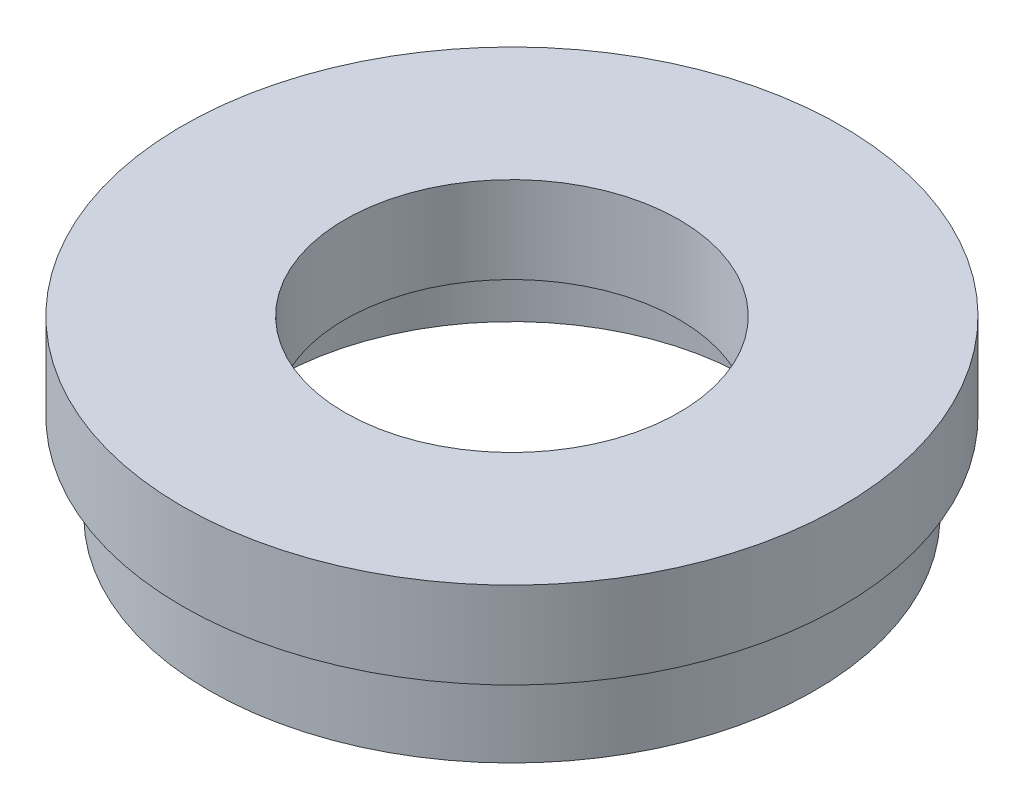
ISO-10303-21;
HEADER;
FILE_DESCRIPTION(('STEP AP214'),'2;1');
FILE_NAME('part.step','',(''),(''),'','','');
FILE_SCHEMA(('AUTOMOTIVE_DESIGN { 1 0 10303 214 1 1 1 1 }'));
ENDSEC;
DATA;
#1=APPLICATION_CONTEXT('core data for automotive mechanical design processes');
#2=APPLICATION_PROTOCOL_DEFINITION('international standard','automotive_design',2000,#1);
#3=PRODUCT_CONTEXT('',#1,'mechanical');
#4=PRODUCT('Part','Part','',(#3));
#5=PRODUCT_RELATED_PRODUCT_CATEGORY('part','',(#4));
#6=PRODUCT_DEFINITION_FORMATION('','',#4);
#7=PRODUCT_DEFINITION_CONTEXT('part definition',#1,'design');
#8=PRODUCT_DEFINITION('design','',#6,#7);
#9=PRODUCT_DEFINITION_SHAPE('','',#8);
#10=(LENGTH_UNIT() NAMED_UNIT(*) SI_UNIT(.MILLI.,.METRE.));
#11=(NAMED_UNIT(*) PLANE_ANGLE_UNIT() SI_UNIT($,.RADIAN.));
#12=(NAMED_UNIT(*) SI_UNIT($,.STERADIAN.) SOLID_ANGLE_UNIT());
#13=UNCERTAINTY_MEASURE_WITH_UNIT(LENGTH_MEASURE(1.E-05),#10,'distance_accuracy_value','');
#14=(GEOMETRIC_REPRESENTATION_CONTEXT(3) GLOBAL_UNCERTAINTY_ASSIGNED_CONTEXT((#13)) GLOBAL_UNIT_ASSIGNED_CONTEXT((#10,
#11,#12)) REPRESENTATION_CONTEXT('',''));
#15=CARTESIAN_POINT('',(0.,0.,0.));
#16=DIRECTION('',(0.,0.,1.));
#17=DIRECTION('',(1.,0.,0.));
#18=AXIS2_PLACEMENT_3D('',#15,#16,#17);
#19=CARTESIAN_POINT('',(0.,13.7446808510638,0.));
#20=DIRECTION('',(0.,1.,0.));
#21=DIRECTION('',(0.,0.,1.));
#22=AXIS2_PLACEMENT_3D('',#19,#20,#21);
#23=CYLINDRICAL_SURFACE('',#22,13.75);
#24=CARTESIAN_POINT('',(0.,0.,0.));
#25=DIRECTION('',(0.,1.,0.));
#26=DIRECTION('',(0.,0.,1.));
#27=AXIS2_PLACEMENT_3D('',#24,#25,#26);
#28=CIRCLE('',#27,13.75);
#29=CARTESIAN_POINT('',(0.,0.,13.75));
#30=VERTEX_POINT('',#29);
#31=EDGE_CURVE('E75',#30,#30,#28,.T.);
#32=ORIENTED_EDGE('',*,*,#31,.F.);
#33=EDGE_LOOP('',(#32));
#34=FACE_BOUND('',#33,.T.);
#35=CARTESIAN_POINT('',(0.,4.,0.));
#36=DIRECTION('',(0.,1.,0.));
#37=DIRECTION('',(0.,0.,1.));
#38=AXIS2_PLACEMENT_3D('',#35,#36,#37);
#39=CIRCLE('',#38,13.75);
#40=CARTESIAN_POINT('',(0.,4.,13.75));
#41=VERTEX_POINT('',#40);
#42=EDGE_CURVE('E10',#41,#41,#39,.T.);
#43=ORIENTED_EDGE('',*,*,#42,.T.);
#44=EDGE_LOOP('',(#43));
#45=FACE_BOUND('',#44,.T.);
#46=ADVANCED_FACE('F35',(#34,#45),#23,.F.);
#47=CARTESIAN_POINT('',(13.75,4.,0.));
#48=DIRECTION('',(0.,-1.,0.));
#49=DIRECTION('',(0.,0.,-1.));
#50=AXIS2_PLACEMENT_3D('',#47,#48,#49);
#51=PLANE('',#50);
#52=ORIENTED_EDGE('',*,*,#42,.F.);
#53=EDGE_LOOP('',(#52));
#54=FACE_BOUND('',#53,.T.);
#55=CARTESIAN_POINT('',(0.,4.,0.));
#56=DIRECTION('',(0.,1.,0.));
#57=DIRECTION('',(0.,0.,1.));
#58=AXIS2_PLACEMENT_3D('',#55,#56,#57);
#59=CIRCLE('',#58,14.35);
#60=CARTESIAN_POINT('',(0.,4.,14.35));
#61=VERTEX_POINT('',#60);
#62=EDGE_CURVE('E41',#61,#61,#59,.T.);
#63=ORIENTED_EDGE('',*,*,#62,.T.);
#64=EDGE_LOOP('',(#63));
#65=FACE_BOUND('',#64,.T.);
#66=ADVANCED_FACE('F82',(#54,#65),#51,.F.);
#67=CARTESIAN_POINT('',(0.,13.7446808510638,0.));
#68=DIRECTION('',(0.,1.,0.));
#69=DIRECTION('',(0.,0.,1.));
#70=AXIS2_PLACEMENT_3D('',#67,#68,#69);
#71=CYLINDRICAL_SURFACE('',#70,14.35);
#72=ORIENTED_EDGE('',*,*,#62,.F.);
#73=EDGE_LOOP('',(#72));
#74=FACE_BOUND('',#73,.T.);
#75=CARTESIAN_POINT('',(0.,5.,0.));
#76=DIRECTION('',(0.,1.,0.));
#77=DIRECTION('',(0.,0.,1.));
#78=AXIS2_PLACEMENT_3D('',#75,#76,#77);
#79=CIRCLE('',#78,14.35);
#80=CARTESIAN_POINT('',(0.,5.,14.35));
#81=VERTEX_POINT('',#80);
#82=EDGE_CURVE('E45',#81,#81,#79,.T.);
#83=ORIENTED_EDGE('',*,*,#82,.T.);
#84=EDGE_LOOP('',(#83));
#85=FACE_BOUND('',#84,.T.);
#86=ADVANCED_FACE('F86',(#74,#85),#71,.F.);
#87=CARTESIAN_POINT('',(14.35,5.,0.));
#88=DIRECTION('',(0.,1.,0.));
#89=DIRECTION('',(0.,0.,1.));
#90=AXIS2_PLACEMENT_3D('',#87,#88,#89);
#91=PLANE('',#90);
#92=ORIENTED_EDGE('',*,*,#82,.F.);
#93=EDGE_LOOP('',(#92));
#94=FACE_BOUND('',#93,.T.);
#95=CARTESIAN_POINT('',(0.,5.,0.));
#96=DIRECTION('',(0.,1.,0.));
#97=DIRECTION('',(0.,0.,1.));
#98=AXIS2_PLACEMENT_3D('',#95,#96,#97);
#99=CIRCLE('',#98,9.66);
#100=CARTESIAN_POINT('',(0.,5.,9.66));
#101=VERTEX_POINT('',#100);
#102=EDGE_CURVE('E49',#101,#101,#99,.T.);
#103=ORIENTED_EDGE('',*,*,#102,.T.);
#104=EDGE_LOOP('',(#103));
#105=FACE_BOUND('',#104,.T.);
#106=ADVANCED_FACE('F91',(#94,#105),#91,.F.);
#107=CARTESIAN_POINT('',(0.,13.7446808510638,0.));
#108=DIRECTION('',(0.,1.,0.));
#109=DIRECTION('',(0.,0.,1.));
#110=AXIS2_PLACEMENT_3D('',#107,#108,#109);
#111=CYLINDRICAL_SURFACE('',#110,9.66);
#112=ORIENTED_EDGE('',*,*,#102,.F.);
#113=EDGE_LOOP('',(#112));
#114=FACE_BOUND('',#113,.T.);
#115=CARTESIAN_POINT('',(0.,10.,0.));
#116=DIRECTION('',(0.,1.,0.));
#117=DIRECTION('',(0.,0.,1.));
#118=AXIS2_PLACEMENT_3D('',#115,#116,#117);
#119=CIRCLE('',#118,9.66);
#120=CARTESIAN_POINT('',(0.,10.,9.66));
#121=VERTEX_POINT('',#120);
#122=EDGE_CURVE('E54',#121,#121,#119,.T.);
#123=ORIENTED_EDGE('',*,*,#122,.T.);
#124=EDGE_LOOP('',(#123));
#125=FACE_BOUND('',#124,.T.);
#126=ADVANCED_FACE('F97',(#114,#125),#111,.F.);
#127=CARTESIAN_POINT('',(9.66,10.,0.));
#128=DIRECTION('',(0.,-1.,0.));
#129=DIRECTION('',(0.,0.,-1.));
#130=AXIS2_PLACEMENT_3D('',#127,#128,#129);
#131=PLANE('',#130);
#132=ORIENTED_EDGE('',*,*,#122,.F.);
#133=EDGE_LOOP('',(#132));
#134=FACE_BOUND('',#133,.T.);
#135=CARTESIAN_POINT('',(0.,10.,0.));
#136=DIRECTION('',(0.,1.,0.));
#137=DIRECTION('',(0.,0.,1.));
#138=AXIS2_PLACEMENT_3D('',#135,#136,#137);
#139=CIRCLE('',#138,19.05);
#140=CARTESIAN_POINT('',(0.,10.,19.05));
#141=VERTEX_POINT('',#140);
#142=EDGE_CURVE('E57',#141,#141,#139,.T.);
#143=ORIENTED_EDGE('',*,*,#142,.T.);
#144=EDGE_LOOP('',(#143));
#145=FACE_BOUND('',#144,.T.);
#146=ADVANCED_FACE('F101',(#134,#145),#131,.F.);
#147=CARTESIAN_POINT('',(0.,13.7446808510638,0.));
#148=DIRECTION('',(0.,1.,0.));
#149=DIRECTION('',(0.,0.,1.));
#150=AXIS2_PLACEMENT_3D('',#147,#148,#149);
#151=CYLINDRICAL_SURFACE('',#150,19.05);
#152=ORIENTED_EDGE('',*,*,#142,.F.);
#153=EDGE_LOOP('',(#152));
#154=FACE_BOUND('',#153,.T.);
#155=CARTESIAN_POINT('',(0.,5.,0.));
#156=DIRECTION('',(0.,1.,0.));
#157=DIRECTION('',(0.,0.,1.));
#158=AXIS2_PLACEMENT_3D('',#155,#156,#157);
#159=CIRCLE('',#158,19.05);
#160=CARTESIAN_POINT('',(0.,5.,19.05));
#161=VERTEX_POINT('',#160);
#162=EDGE_CURVE('E60',#161,#161,#159,.T.);
#163=ORIENTED_EDGE('',*,*,#162,.T.);
#164=EDGE_LOOP('',(#163));
#165=FACE_BOUND('',#164,.T.);
#166=ADVANCED_FACE('F105',(#154,#165),#151,.T.);
#167=CARTESIAN_POINT('',(19.05,5.,0.));
#168=DIRECTION('',(0.,1.,0.));
#169=DIRECTION('',(0.,0.,1.));
#170=AXIS2_PLACEMENT_3D('',#167,#168,#169);
#171=PLANE('',#170);
#172=ORIENTED_EDGE('',*,*,#162,.F.);
#173=EDGE_LOOP('',(#172));
#174=FACE_BOUND('',#173,.T.);
#175=CARTESIAN_POINT('',(0.,5.,0.));
#176=DIRECTION('',(0.,1.,0.));
#177=DIRECTION('',(0.,0.,1.));
#178=AXIS2_PLACEMENT_3D('',#175,#176,#177);
#179=CIRCLE('',#178,17.);
#180=CARTESIAN_POINT('',(0.,5.,17.));
#181=VERTEX_POINT('',#180);
#182=EDGE_CURVE('E63',#181,#181,#179,.T.);
#183=ORIENTED_EDGE('',*,*,#182,.T.);
#184=EDGE_LOOP('',(#183));
#185=FACE_BOUND('',#184,.T.);
#186=ADVANCED_FACE('F109',(#174,#185),#171,.F.);
#187=CARTESIAN_POINT('',(0.,13.7446808510638,0.));
#188=DIRECTION('',(0.,1.,0.));
#189=DIRECTION('',(0.,0.,1.));
#190=AXIS2_PLACEMENT_3D('',#187,#188,#189);
#191=CYLINDRICAL_SURFACE('',#190,17.);
#192=ORIENTED_EDGE('',*,*,#182,.F.);
#193=EDGE_LOOP('',(#192));
#194=FACE_BOUND('',#193,.T.);
#195=CARTESIAN_POINT('',(0.,4.,0.));
#196=DIRECTION('',(0.,1.,0.));
#197=DIRECTION('',(0.,0.,1.));
#198=AXIS2_PLACEMENT_3D('',#195,#196,#197);
#199=CIRCLE('',#198,17.);
#200=CARTESIAN_POINT('',(0.,4.,17.));
#201=VERTEX_POINT('',#200);
#202=EDGE_CURVE('E66',#201,#201,#199,.T.);
#203=ORIENTED_EDGE('',*,*,#202,.T.);
#204=EDGE_LOOP('',(#203));
#205=FACE_BOUND('',#204,.T.);
#206=ADVANCED_FACE('F113',(#194,#205),#191,.T.);
#207=CARTESIAN_POINT('',(17.,4.,0.));
#208=DIRECTION('',(0.,-1.,0.));
#209=DIRECTION('',(0.,0.,-1.));
#210=AXIS2_PLACEMENT_3D('',#207,#208,#209);
#211=PLANE('',#210);
#212=ORIENTED_EDGE('',*,*,#202,.F.);
#213=EDGE_LOOP('',(#212));
#214=FACE_BOUND('',#213,.T.);
#215=CARTESIAN_POINT('',(0.,4.,0.));
#216=DIRECTION('',(0.,1.,0.));
#217=DIRECTION('',(0.,0.,1.));
#218=AXIS2_PLACEMENT_3D('',#215,#216,#217);
#219=CIRCLE('',#218,17.5);
#220=CARTESIAN_POINT('',(0.,4.,17.5));
#221=VERTEX_POINT('',#220);
#222=EDGE_CURVE('E69',#221,#221,#219,.T.);
#223=ORIENTED_EDGE('',*,*,#222,.T.);
#224=EDGE_LOOP('',(#223));
#225=FACE_BOUND('',#224,.T.);
#226=ADVANCED_FACE('F117',(#214,#225),#211,.F.);
#227=CARTESIAN_POINT('',(0.,13.7446808510638,0.));
#228=DIRECTION('',(0.,1.,0.));
#229=DIRECTION('',(0.,0.,1.));
#230=AXIS2_PLACEMENT_3D('',#227,#228,#229);
#231=CYLINDRICAL_SURFACE('',#230,17.5);
#232=ORIENTED_EDGE('',*,*,#222,.F.);
#233=EDGE_LOOP('',(#232));
#234=FACE_BOUND('',#233,.T.);
#235=CARTESIAN_POINT('',(0.,0.,0.));
#236=DIRECTION('',(0.,1.,0.));
#237=DIRECTION('',(0.,0.,1.));
#238=AXIS2_PLACEMENT_3D('',#235,#236,#237);
#239=CIRCLE('',#238,17.5);
#240=CARTESIAN_POINT('',(0.,0.,17.5));
#241=VERTEX_POINT('',#240);
#242=EDGE_CURVE('E72',#241,#241,#239,.T.);
#243=ORIENTED_EDGE('',*,*,#242,.T.);
#244=EDGE_LOOP('',(#243));
#245=FACE_BOUND('',#244,.T.);
#246=ADVANCED_FACE('F121',(#234,#245),#231,.T.);
#247=CARTESIAN_POINT('',(17.5,0.,0.));
#248=DIRECTION('',(0.,1.,0.));
#249=DIRECTION('',(0.,0.,1.));
#250=AXIS2_PLACEMENT_3D('',#247,#248,#249);
#251=PLANE('',#250);
#252=ORIENTED_EDGE('',*,*,#242,.F.);
#253=EDGE_LOOP('',(#252));
#254=FACE_BOUND('',#253,.T.);
#255=ORIENTED_EDGE('',*,*,#31,.T.);
#256=EDGE_LOOP('',(#255));
#257=FACE_BOUND('',#256,.T.);
#258=ADVANCED_FACE('F79',(#254,#257),#251,.F.);
#259=CLOSED_SHELL('',(#46,#66,#86,#106,#126,#146,#166,#186,#206,#226,#246,#258));
#260=MANIFOLD_SOLID_BREP('B2',#259);
#261=ADVANCED_BREP_SHAPE_REPRESENTATION('',(#18,#260),#14);
#262=SHAPE_DEFINITION_REPRESENTATION(#9,#261);
ENDSEC;
END-ISO-10303-21;
